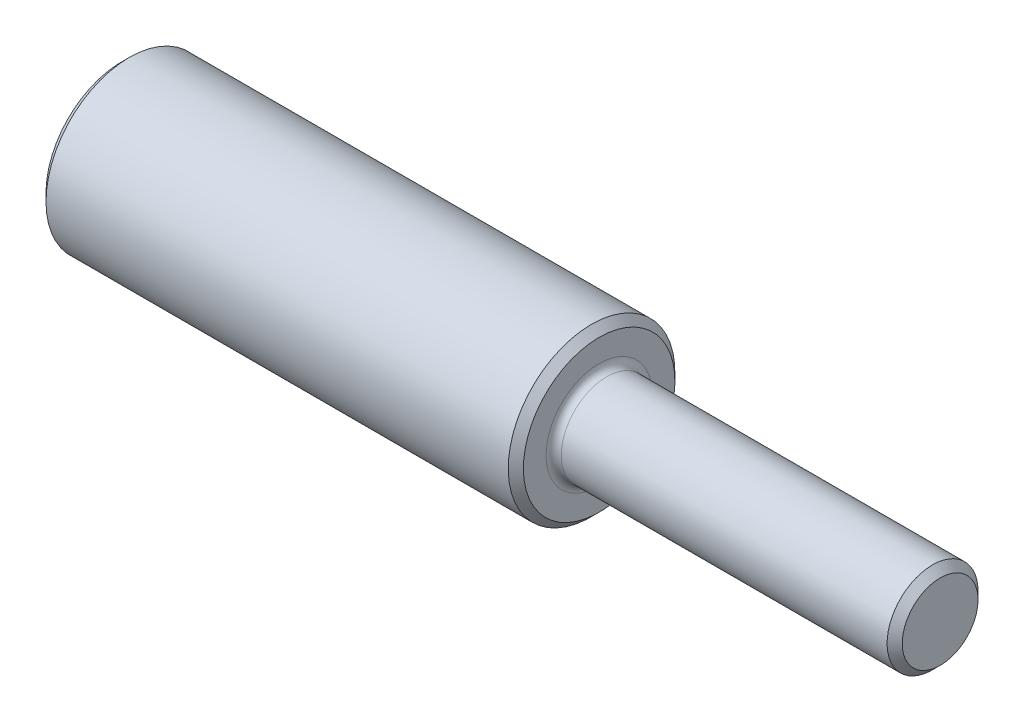
ISO-10303-21;
HEADER;
FILE_DESCRIPTION(('STEP AP214'),'2;1');
FILE_NAME('part.step','',(''),(''),'','','');
FILE_SCHEMA(('AUTOMOTIVE_DESIGN { 1 0 10303 214 1 1 1 1 }'));
ENDSEC;
DATA;
#1=APPLICATION_CONTEXT('core data for automotive mechanical design processes');
#2=APPLICATION_PROTOCOL_DEFINITION('international standard','automotive_design',2000,#1);
#3=PRODUCT_CONTEXT('',#1,'mechanical');
#4=PRODUCT('Part','Part','',(#3));
#5=PRODUCT_RELATED_PRODUCT_CATEGORY('part','',(#4));
#6=PRODUCT_DEFINITION_FORMATION('','',#4);
#7=PRODUCT_DEFINITION_CONTEXT('part definition',#1,'design');
#8=PRODUCT_DEFINITION('design','',#6,#7);
#9=PRODUCT_DEFINITION_SHAPE('','',#8);
#10=(LENGTH_UNIT() NAMED_UNIT(*) SI_UNIT(.MILLI.,.METRE.));
#11=(NAMED_UNIT(*) PLANE_ANGLE_UNIT() SI_UNIT($,.RADIAN.));
#12=(NAMED_UNIT(*) SI_UNIT($,.STERADIAN.) SOLID_ANGLE_UNIT());
#13=UNCERTAINTY_MEASURE_WITH_UNIT(LENGTH_MEASURE(1.E-05),#10,'distance_accuracy_value','');
#14=(GEOMETRIC_REPRESENTATION_CONTEXT(3) GLOBAL_UNCERTAINTY_ASSIGNED_CONTEXT((#13)) GLOBAL_UNIT_ASSIGNED_CONTEXT((#10,
#11,#12)) REPRESENTATION_CONTEXT('',''));
#15=CARTESIAN_POINT('',(0.,0.,0.));
#16=DIRECTION('',(0.,0.,1.));
#17=DIRECTION('',(1.,0.,0.));
#18=AXIS2_PLACEMENT_3D('',#15,#16,#17);
#19=CARTESIAN_POINT('',(108.,6.00000000000001,0.));
#20=DIRECTION('',(1.,0.,0.));
#21=DIRECTION('',(0.,1.,0.));
#22=AXIS2_PLACEMENT_3D('',#19,#20,#21);
#23=PLANE('',#22);
#24=CARTESIAN_POINT('',(108.,0.,0.));
#25=DIRECTION('',(1.,0.,0.));
#26=DIRECTION('',(0.,1.,0.));
#27=AXIS2_PLACEMENT_3D('',#24,#25,#26);
#28=CIRCLE('',#27,5.);
#29=CARTESIAN_POINT('',(108.,5.,0.));
#30=VERTEX_POINT('',#29);
#31=EDGE_CURVE('E214',#30,#30,#28,.T.);
#32=ORIENTED_EDGE('',*,*,#31,.T.);
#33=EDGE_LOOP('',(#32));
#34=FACE_BOUND('',#33,.T.);
#35=ADVANCED_FACE('F54',(#34),#23,.T.);
#36=CARTESIAN_POINT('',(113.83382386817,0.,0.));
#37=DIRECTION('',(1.,0.,0.));
#38=DIRECTION('',(0.,1.,0.));
#39=AXIS2_PLACEMENT_3D('',#36,#37,#38);
#40=CYLINDRICAL_SURFACE('',#39,6.00000000000002);
#41=CARTESIAN_POINT('',(107.,0.,0.));
#42=DIRECTION('',(1.,0.,0.));
#43=DIRECTION('',(0.,1.,0.));
#44=AXIS2_PLACEMENT_3D('',#41,#42,#43);
#45=CIRCLE('',#44,6.00000000000002);
#46=CARTESIAN_POINT('',(107.,6.00000000000002,0.));
#47=VERTEX_POINT('',#46);
#48=EDGE_CURVE('E217',#47,#47,#45,.F.);
#49=ORIENTED_EDGE('',*,*,#48,.T.);
#50=EDGE_LOOP('',(#49));
#51=FACE_BOUND('',#50,.T.);
#52=CARTESIAN_POINT('',(64.,0.,0.));
#53=DIRECTION('',(1.,0.,0.));
#54=DIRECTION('',(0.,1.,0.));
#55=AXIS2_PLACEMENT_3D('',#52,#53,#54);
#56=CIRCLE('',#55,6.00000000000002);
#57=CARTESIAN_POINT('',(64.,6.00000000000001,0.));
#58=VERTEX_POINT('',#57);
#59=EDGE_CURVE('E159',#58,#58,#56,.T.);
#60=ORIENTED_EDGE('',*,*,#59,.T.);
#61=EDGE_LOOP('',(#60));
#62=FACE_BOUND('',#61,.T.);
#63=ADVANCED_FACE('F204',(#51,#62),#40,.T.);
#64=CARTESIAN_POINT('',(64.,0.,0.));
#65=DIRECTION('',(1.,0.,0.));
#66=DIRECTION('',(0.,1.,0.));
#67=AXIS2_PLACEMENT_3D('',#64,#65,#66);
#68=TOROIDAL_SURFACE('',#67,7.00000000000002,1.00000000000001);
#69=CARTESIAN_POINT('',(63.,0.,0.));
#70=DIRECTION('',(1.,0.,0.));
#71=DIRECTION('',(0.,1.,0.));
#72=AXIS2_PLACEMENT_3D('',#69,#70,#71);
#73=CIRCLE('',#72,7.00000000000002);
#74=CARTESIAN_POINT('',(63.,7.00000000000001,0.));
#75=VERTEX_POINT('',#74);
#76=EDGE_CURVE('E150',#75,#75,#73,.T.);
#77=ORIENTED_EDGE('',*,*,#76,.T.);
#78=EDGE_LOOP('',(#77));
#79=FACE_BOUND('',#78,.T.);
#80=ORIENTED_EDGE('',*,*,#59,.F.);
#81=EDGE_LOOP('',(#80));
#82=FACE_BOUND('',#81,.T.);
#83=ADVANCED_FACE('F200',(#79,#82),#68,.F.);
#84=CARTESIAN_POINT('',(63.,11.,0.));
#85=DIRECTION('',(1.,0.,0.));
#86=DIRECTION('',(0.,1.,0.));
#87=AXIS2_PLACEMENT_3D('',#84,#85,#86);
#88=PLANE('',#87);
#89=CARTESIAN_POINT('',(63.,0.,0.));
#90=DIRECTION('',(1.,0.,0.));
#91=DIRECTION('',(0.,1.,0.));
#92=AXIS2_PLACEMENT_3D('',#89,#90,#91);
#93=CIRCLE('',#92,10.);
#94=CARTESIAN_POINT('',(63.,10.,0.));
#95=VERTEX_POINT('',#94);
#96=EDGE_CURVE('E224',#95,#95,#93,.T.);
#97=ORIENTED_EDGE('',*,*,#96,.T.);
#98=EDGE_LOOP('',(#97));
#99=FACE_BOUND('',#98,.T.);
#100=ORIENTED_EDGE('',*,*,#76,.F.);
#101=EDGE_LOOP('',(#100));
#102=FACE_BOUND('',#101,.T.);
#103=ADVANCED_FACE('F196',(#99,#102),#88,.T.);
#104=CARTESIAN_POINT('',(113.83382386817,0.,0.));
#105=DIRECTION('',(1.,0.,0.));
#106=DIRECTION('',(0.,1.,0.));
#107=AXIS2_PLACEMENT_3D('',#104,#105,#106);
#108=CYLINDRICAL_SURFACE('',#107,11.);
#109=CARTESIAN_POINT('',(62.,0.,0.));
#110=DIRECTION('',(1.,0.,0.));
#111=DIRECTION('',(0.,1.,0.));
#112=AXIS2_PLACEMENT_3D('',#109,#110,#111);
#113=CIRCLE('',#112,11.);
#114=CARTESIAN_POINT('',(62.,11.,0.));
#115=VERTEX_POINT('',#114);
#116=EDGE_CURVE('E13',#115,#115,#113,.F.);
#117=ORIENTED_EDGE('',*,*,#116,.T.);
#118=EDGE_LOOP('',(#117));
#119=FACE_BOUND('',#118,.T.);
#120=CARTESIAN_POINT('',(1.00000000000004,0.,0.));
#121=DIRECTION('',(-1.,0.,0.));
#122=DIRECTION('',(0.,-1.,0.));
#123=AXIS2_PLACEMENT_3D('',#120,#121,#122);
#124=CIRCLE('',#123,11.);
#125=CARTESIAN_POINT('',(1.00000000000004,-11.,0.));
#126=VERTEX_POINT('',#125);
#127=EDGE_CURVE('E64',#126,#126,#124,.F.);
#128=ORIENTED_EDGE('',*,*,#127,.T.);
#129=EDGE_LOOP('',(#128));
#130=FACE_BOUND('',#129,.T.);
#131=ADVANCED_FACE('F192',(#119,#130),#108,.T.);
#132=CARTESIAN_POINT('',(0.,0.,0.));
#133=DIRECTION('',(-1.,0.,0.));
#134=DIRECTION('',(0.,-1.,0.));
#135=AXIS2_PLACEMENT_3D('',#132,#133,#134);
#136=PLANE('',#135);
#137=CARTESIAN_POINT('',(0.,0.,0.));
#138=DIRECTION('',(-1.,0.,0.));
#139=DIRECTION('',(0.,-1.,0.));
#140=AXIS2_PLACEMENT_3D('',#137,#138,#139);
#141=CIRCLE('',#140,9.99999999999998);
#142=CARTESIAN_POINT('',(0.,-9.99999999999999,0.));
#143=VERTEX_POINT('',#142);
#144=EDGE_CURVE('E173',#143,#143,#141,.T.);
#145=ORIENTED_EDGE('',*,*,#144,.T.);
#146=EDGE_LOOP('',(#145));
#147=FACE_BOUND('',#146,.T.);
#148=DIRECTION('',(0.,0.,-1.));
#149=VECTOR('',#148,1.);
#150=CARTESIAN_POINT('',(0.,2.5,-9.29999999999998));
#151=LINE('',#150,#149);
#152=CARTESIAN_POINT('',(0.,2.5,-7.59934207678535));
#153=VERTEX_POINT('',#152);
#154=CARTESIAN_POINT('',(0.,2.5,-9.29999999999998));
#155=VERTEX_POINT('',#154);
#156=EDGE_CURVE('E141',#153,#155,#151,.T.);
#157=ORIENTED_EDGE('',*,*,#156,.F.);
#158=CARTESIAN_POINT('',(0.,0.,0.));
#159=DIRECTION('',(-1.,0.,0.));
#160=DIRECTION('',(0.,-1.,0.));
#161=AXIS2_PLACEMENT_3D('',#158,#159,#160);
#162=CIRCLE('',#161,8.00000000000002);
#163=CARTESIAN_POINT('',(0.,-2.5,-7.59934207678535));
#164=VERTEX_POINT('',#163);
#165=EDGE_CURVE('E71',#153,#164,#162,.F.);
#166=ORIENTED_EDGE('',*,*,#165,.T.);
#167=DIRECTION('',(0.,0.,1.));
#168=VECTOR('',#167,1.);
#169=CARTESIAN_POINT('',(0.,-2.5,-9.29999999999998));
#170=LINE('',#169,#168);
#171=CARTESIAN_POINT('',(0.,-2.5,-9.29999999999998));
#172=VERTEX_POINT('',#171);
#173=EDGE_CURVE('E130',#172,#164,#170,.T.);
#174=ORIENTED_EDGE('',*,*,#173,.F.);
#175=DIRECTION('',(0.,-1.,0.));
#176=VECTOR('',#175,1.);
#177=CARTESIAN_POINT('',(0.,-2.5,-9.29999999999998));
#178=LINE('',#177,#176);
#179=EDGE_CURVE('E134',#155,#172,#178,.T.);
#180=ORIENTED_EDGE('',*,*,#179,.F.);
#181=EDGE_LOOP('',(#157,#166,#174,#180));
#182=FACE_BOUND('',#181,.T.);
#183=ADVANCED_FACE('F189',(#147,#182),#136,.T.);
#184=CARTESIAN_POINT('',(35.,0.,0.));
#185=DIRECTION('',(-1.,0.,0.));
#186=DIRECTION('',(0.,-1.,0.));
#187=AXIS2_PLACEMENT_3D('',#184,#185,#186);
#188=CYLINDRICAL_SURFACE('',#187,7.);
#189=DIRECTION('',(-1.,0.,0.));
#190=VECTOR('',#189,1.);
#191=CARTESIAN_POINT('',(35.,-2.5,-6.53834841531101));
#192=LINE('',#191,#190);
#193=CARTESIAN_POINT('',(35.,-2.5,-6.53834841531101));
#194=VERTEX_POINT('',#193);
#195=CARTESIAN_POINT('',(1.00000000000001,-2.49999999999999,-6.53834841531101));
#196=VERTEX_POINT('',#195);
#197=EDGE_CURVE('E147',#194,#196,#192,.T.);
#198=ORIENTED_EDGE('',*,*,#197,.T.);
#199=CARTESIAN_POINT('',(1.00000000000001,0.,0.));
#200=DIRECTION('',(-1.,0.,0.));
#201=DIRECTION('',(0.,-1.,0.));
#202=AXIS2_PLACEMENT_3D('',#199,#200,#201);
#203=CIRCLE('',#202,7.);
#204=CARTESIAN_POINT('',(1.00000000000001,2.50000000000001,-6.53834841531101));
#205=VERTEX_POINT('',#204);
#206=EDGE_CURVE('E112',#196,#205,#203,.T.);
#207=ORIENTED_EDGE('',*,*,#206,.T.);
#208=DIRECTION('',(-1.,0.,0.));
#209=VECTOR('',#208,1.);
#210=CARTESIAN_POINT('',(35.,2.5,-6.53834841531101));
#211=LINE('',#210,#209);
#212=CARTESIAN_POINT('',(35.,2.5,-6.53834841531101));
#213=VERTEX_POINT('',#212);
#214=EDGE_CURVE('E104',#213,#205,#211,.T.);
#215=ORIENTED_EDGE('',*,*,#214,.F.);
#216=CARTESIAN_POINT('',(35.,0.,0.));
#217=DIRECTION('',(-1.,0.,0.));
#218=DIRECTION('',(0.,-1.,0.));
#219=AXIS2_PLACEMENT_3D('',#216,#217,#218);
#220=CIRCLE('',#219,7.);
#221=EDGE_CURVE('E109',#194,#213,#220,.T.);
#222=ORIENTED_EDGE('',*,*,#221,.F.);
#223=EDGE_LOOP('',(#198,#207,#215,#222));
#224=FACE_BOUND('',#223,.T.);
#225=ADVANCED_FACE('F107',(#224),#188,.F.);
#226=CARTESIAN_POINT('',(35.,-2.5,-9.29999999999993));
#227=DIRECTION('',(0.,-1.,0.));
#228=DIRECTION('',(1.,0.,0.));
#229=AXIS2_PLACEMENT_3D('',#226,#227,#228);
#230=PLANE('',#229);
#231=ORIENTED_EDGE('',*,*,#173,.T.);
#232=CARTESIAN_POINT('',(0.,-2.5,-7.59934207678535));
#233=CARTESIAN_POINT('',(0.0836781462884852,-2.5,-7.51125145382426));
#234=CARTESIAN_POINT('',(0.167282363775728,-2.5,-7.42309054472363));
#235=CARTESIAN_POINT('',(0.334324758920643,-2.5,-7.2466123077384));
#236=CARTESIAN_POINT('',(0.417762937304146,-2.5,-7.15829498054079));
#237=CARTESIAN_POINT('',(0.584455873441062,-2.5,-6.98148721724312));
#238=CARTESIAN_POINT('',(0.667710631044969,-2.5,-6.89299678100207));
#239=CARTESIAN_POINT('',(0.834014886628027,-2.5,-6.71582252727196));
#240=CARTESIAN_POINT('',(0.917064383705736,-2.5,-6.62713870893684));
#241=CARTESIAN_POINT('',(1.00000000000001,-2.49999999999999,-6.53834841531101));
#242=B_SPLINE_CURVE_WITH_KNOTS('',3,(#232,#233,#234,#235,#236,#237,#238,#239,#240,#241),
.UNSPECIFIED.,.F.,.F.,(4,2,2,2,4),(0.,0.364496810187142,0.728992023478612,1.09348753375914,
1.45798464195836),.UNSPECIFIED.);
#243=EDGE_CURVE('E218',#164,#196,#242,.T.);
#244=ORIENTED_EDGE('',*,*,#243,.T.);
#245=ORIENTED_EDGE('',*,*,#197,.F.);
#246=DIRECTION('',(0.,0.,1.));
#247=VECTOR('',#246,1.);
#248=CARTESIAN_POINT('',(35.,-2.5,-9.29999999999993));
#249=LINE('',#248,#247);
#250=CARTESIAN_POINT('',(35.,-2.5,-9.29999999999993));
#251=VERTEX_POINT('',#250);
#252=EDGE_CURVE('E115',#251,#194,#249,.T.);
#253=ORIENTED_EDGE('',*,*,#252,.F.);
#254=DIRECTION('',(-1.,0.,0.));
#255=VECTOR('',#254,1.);
#256=CARTESIAN_POINT('',(35.,-2.5,-9.29999999999993));
#257=LINE('',#256,#255);
#258=EDGE_CURVE('E151',#251,#172,#257,.T.);
#259=ORIENTED_EDGE('',*,*,#258,.T.);
#260=EDGE_LOOP('',(#231,#244,#245,#253,#259));
#261=FACE_BOUND('',#260,.T.);
#262=ADVANCED_FACE('F188',(#261),#230,.F.);
#263=CARTESIAN_POINT('',(35.,-2.5,-9.29999999999993));
#264=DIRECTION('',(0.,0.,-1.));
#265=DIRECTION('',(-1.,0.,0.));
#266=AXIS2_PLACEMENT_3D('',#263,#264,#265);
#267=PLANE('',#266);
#268=ORIENTED_EDGE('',*,*,#179,.T.);
#269=ORIENTED_EDGE('',*,*,#258,.F.);
#270=DIRECTION('',(0.,-1.,0.));
#271=VECTOR('',#270,1.);
#272=CARTESIAN_POINT('',(35.,-2.5,-9.29999999999993));
#273=LINE('',#272,#271);
#274=CARTESIAN_POINT('',(35.,2.5,-9.29999999999993));
#275=VERTEX_POINT('',#274);
#276=EDGE_CURVE('E125',#275,#251,#273,.T.);
#277=ORIENTED_EDGE('',*,*,#276,.F.);
#278=DIRECTION('',(-1.,0.,0.));
#279=VECTOR('',#278,1.);
#280=CARTESIAN_POINT('',(35.,2.5,-9.29999999999993));
#281=LINE('',#280,#279);
#282=EDGE_CURVE('E114',#275,#155,#281,.T.);
#283=ORIENTED_EDGE('',*,*,#282,.T.);
#284=EDGE_LOOP('',(#268,#269,#277,#283));
#285=FACE_BOUND('',#284,.T.);
#286=ADVANCED_FACE('F184',(#285),#267,.F.);
#287=CARTESIAN_POINT('',(35.,2.5,-9.29999999999993));
#288=DIRECTION('',(0.,1.,0.));
#289=DIRECTION('',(0.,0.,1.));
#290=AXIS2_PLACEMENT_3D('',#287,#288,#289);
#291=PLANE('',#290);
#292=ORIENTED_EDGE('',*,*,#214,.T.);
#293=CARTESIAN_POINT('',(1.00000000000001,2.50000000000001,-6.53834841531101));
#294=CARTESIAN_POINT('',(0.917064383705736,2.5,-6.62713870893683));
#295=CARTESIAN_POINT('',(0.834014886628027,2.5,-6.71582252727196));
#296=CARTESIAN_POINT('',(0.667710631044969,2.5,-6.89299678100207));
#297=CARTESIAN_POINT('',(0.584455873441062,2.5,-6.98148721724312));
#298=CARTESIAN_POINT('',(0.417762937304145,2.5,-7.15829498054079));
#299=CARTESIAN_POINT('',(0.334324758920642,2.5,-7.2466123077384));
#300=CARTESIAN_POINT('',(0.167282363775727,2.5,-7.42309054472363));
#301=CARTESIAN_POINT('',(0.0836781462884843,2.5,-7.51125145382426));
#302=CARTESIAN_POINT('',(0.,2.5,-7.59934207678535));
#303=B_SPLINE_CURVE_WITH_KNOTS('',3,(#293,#294,#295,#296,#297,#298,#299,#300,#301,#302),
.UNSPECIFIED.,.F.,.F.,(4,2,2,2,4),(0.,0.36449710819922,0.728992618479744,1.09348783177121,
1.45798464195836),.UNSPECIFIED.);
#304=EDGE_CURVE('E79',#205,#153,#303,.T.);
#305=ORIENTED_EDGE('',*,*,#304,.T.);
#306=ORIENTED_EDGE('',*,*,#156,.T.);
#307=ORIENTED_EDGE('',*,*,#282,.F.);
#308=DIRECTION('',(0.,0.,-1.));
#309=VECTOR('',#308,1.);
#310=CARTESIAN_POINT('',(35.,2.5,-9.29999999999993));
#311=LINE('',#310,#309);
#312=EDGE_CURVE('E118',#213,#275,#311,.T.);
#313=ORIENTED_EDGE('',*,*,#312,.F.);
#314=EDGE_LOOP('',(#292,#305,#306,#307,#313));
#315=FACE_BOUND('',#314,.T.);
#316=ADVANCED_FACE('F119',(#315),#291,.F.);
#317=CARTESIAN_POINT('',(35.,0.,0.));
#318=DIRECTION('',(-1.,0.,0.));
#319=DIRECTION('',(0.,-1.,0.));
#320=AXIS2_PLACEMENT_3D('',#317,#318,#319);
#321=PLANE('',#320);
#322=ORIENTED_EDGE('',*,*,#221,.T.);
#323=ORIENTED_EDGE('',*,*,#312,.T.);
#324=ORIENTED_EDGE('',*,*,#276,.T.);
#325=ORIENTED_EDGE('',*,*,#252,.T.);
#326=EDGE_LOOP('',(#322,#323,#324,#325));
#327=FACE_BOUND('',#326,.T.);
#328=ADVANCED_FACE('F127',(#327),#321,.T.);
#329=CARTESIAN_POINT('',(1.00000000000001,0.,0.));
#330=DIRECTION('',(-1.,0.,0.));
#331=DIRECTION('',(0.,-1.,0.));
#332=AXIS2_PLACEMENT_3D('',#329,#330,#331);
#333=CONICAL_SURFACE('',#332,7.,0.785398163397451);
#334=ORIENTED_EDGE('',*,*,#243,.F.);
#335=ORIENTED_EDGE('',*,*,#165,.F.);
#336=ORIENTED_EDGE('',*,*,#304,.F.);
#337=ORIENTED_EDGE('',*,*,#206,.F.);
#338=EDGE_LOOP('',(#334,#335,#336,#337));
#339=FACE_BOUND('',#338,.T.);
#340=ADVANCED_FACE('F176',(#339),#333,.F.);
#341=CARTESIAN_POINT('',(108.,0.,0.));
#342=DIRECTION('',(-1.,0.,0.));
#343=DIRECTION('',(0.,-1.,0.));
#344=AXIS2_PLACEMENT_3D('',#341,#342,#343);
#345=CONICAL_SURFACE('',#344,5.,0.785398163397447);
#346=ORIENTED_EDGE('',*,*,#48,.F.);
#347=EDGE_LOOP('',(#346));
#348=FACE_BOUND('',#347,.T.);
#349=ORIENTED_EDGE('',*,*,#31,.F.);
#350=EDGE_LOOP('',(#349));
#351=FACE_BOUND('',#350,.T.);
#352=ADVANCED_FACE('F246',(#348,#351),#345,.T.);
#353=CARTESIAN_POINT('',(63.,0.,0.));
#354=DIRECTION('',(-1.,0.,0.));
#355=DIRECTION('',(0.,-1.,0.));
#356=AXIS2_PLACEMENT_3D('',#353,#354,#355);
#357=CONICAL_SURFACE('',#356,10.,0.785398163397449);
#358=ORIENTED_EDGE('',*,*,#116,.F.);
#359=EDGE_LOOP('',(#358));
#360=FACE_BOUND('',#359,.T.);
#361=ORIENTED_EDGE('',*,*,#96,.F.);
#362=EDGE_LOOP('',(#361));
#363=FACE_BOUND('',#362,.T.);
#364=ADVANCED_FACE('F241',(#360,#363),#357,.T.);
#365=CARTESIAN_POINT('',(1.00000000000004,0.,0.));
#366=DIRECTION('',(1.,0.,0.));
#367=DIRECTION('',(0.,1.,0.));
#368=AXIS2_PLACEMENT_3D('',#365,#366,#367);
#369=CONICAL_SURFACE('',#368,11.,0.785398163397442);
#370=ORIENTED_EDGE('',*,*,#144,.F.);
#371=EDGE_LOOP('',(#370));
#372=FACE_BOUND('',#371,.T.);
#373=ORIENTED_EDGE('',*,*,#127,.F.);
#374=EDGE_LOOP('',(#373));
#375=FACE_BOUND('',#374,.T.);
#376=ADVANCED_FACE('F57',(#372,#375),#369,.T.);
#377=CLOSED_SHELL('',(#35,#63,#83,#103,#131,#183,#225,#262,#286,#316,#328,#340,#352,#364,#376));
#378=MANIFOLD_SOLID_BREP('B2',#377);
#379=ADVANCED_BREP_SHAPE_REPRESENTATION('',(#18,#378),#14);
#380=SHAPE_DEFINITION_REPRESENTATION(#9,#379);
ENDSEC;
END-ISO-10303-21;
